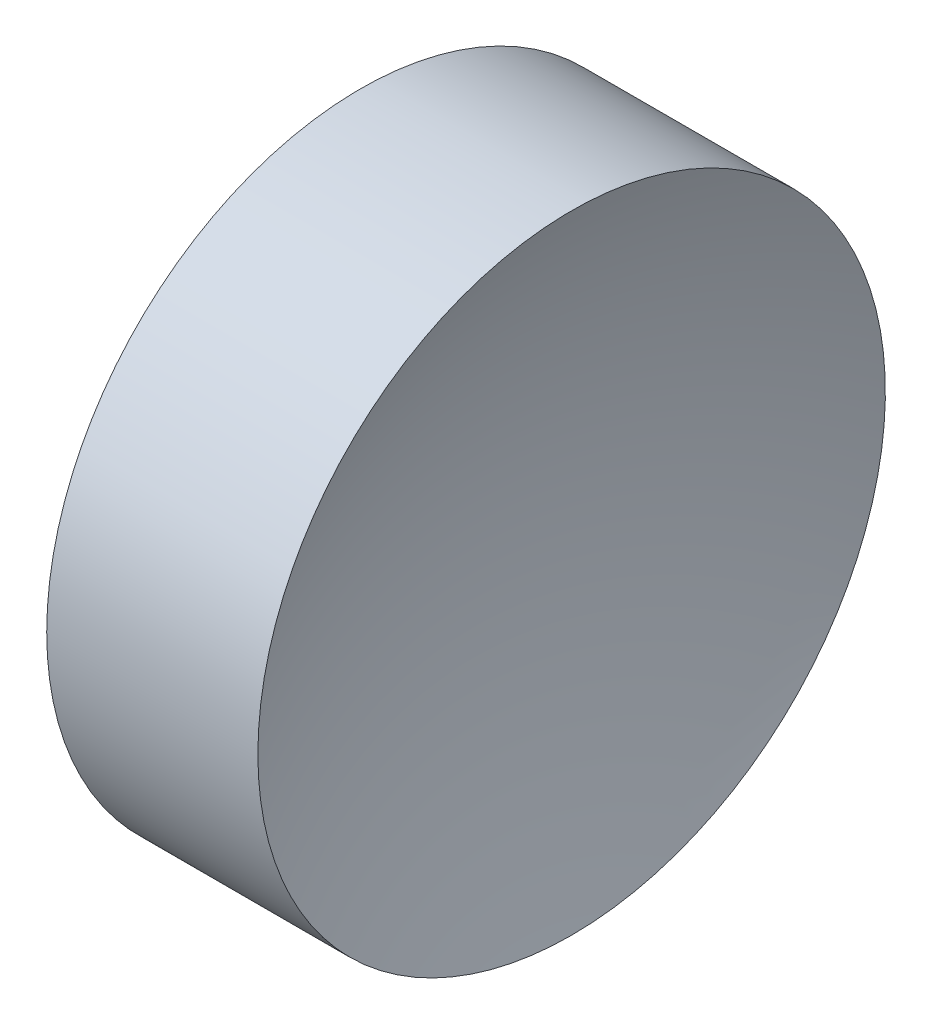
ISO-10303-21;
HEADER;
FILE_DESCRIPTION(('STEP AP214'),'2;1');
FILE_NAME('part.step','',(''),(''),'','','');
FILE_SCHEMA(('AUTOMOTIVE_DESIGN { 1 0 10303 214 1 1 1 1 }'));
ENDSEC;
DATA;
#1=APPLICATION_CONTEXT('core data for automotive mechanical design processes');
#2=APPLICATION_PROTOCOL_DEFINITION('international standard','automotive_design',2000,#1);
#3=PRODUCT_CONTEXT('',#1,'mechanical');
#4=PRODUCT('Part','Part','',(#3));
#5=PRODUCT_RELATED_PRODUCT_CATEGORY('part','',(#4));
#6=PRODUCT_DEFINITION_FORMATION('','',#4);
#7=PRODUCT_DEFINITION_CONTEXT('part definition',#1,'design');
#8=PRODUCT_DEFINITION('design','',#6,#7);
#9=PRODUCT_DEFINITION_SHAPE('','',#8);
#10=(LENGTH_UNIT() NAMED_UNIT(*) SI_UNIT(.MILLI.,.METRE.));
#11=(NAMED_UNIT(*) PLANE_ANGLE_UNIT() SI_UNIT($,.RADIAN.));
#12=(NAMED_UNIT(*) SI_UNIT($,.STERADIAN.) SOLID_ANGLE_UNIT());
#13=UNCERTAINTY_MEASURE_WITH_UNIT(LENGTH_MEASURE(1.E-05),#10,'distance_accuracy_value','');
#14=(GEOMETRIC_REPRESENTATION_CONTEXT(3) GLOBAL_UNCERTAINTY_ASSIGNED_CONTEXT((#13)) GLOBAL_UNIT_ASSIGNED_CONTEXT((#10,
#11,#12)) REPRESENTATION_CONTEXT('',''));
#15=CARTESIAN_POINT('',(0.,0.,0.));
#16=DIRECTION('',(0.,0.,1.));
#17=DIRECTION('',(1.,0.,0.));
#18=AXIS2_PLACEMENT_3D('',#15,#16,#17);
#19=CARTESIAN_POINT('',(31.984210290843,13.0445205745975,0.));
#20=DIRECTION('',(-1.,0.,0.));
#21=DIRECTION('',(0.,-1.,0.));
#22=AXIS2_PLACEMENT_3D('',#19,#20,#21);
#23=SPHERICAL_SURFACE('',#22,8.31202046606303);
#24=CARTESIAN_POINT('',(24.2921894752023,13.0445205745975,0.));
#25=DIRECTION('',(-1.,0.,0.));
#26=DIRECTION('',(0.,0.,1.));
#27=AXIS2_PLACEMENT_3D('',#24,#25,#26);
#28=CIRCLE('',#27,3.15);
#29=CARTESIAN_POINT('',(24.2921894752023,13.0445205745975,3.15));
#30=VERTEX_POINT('',#29);
#31=EDGE_CURVE('E10',#30,#30,#28,.T.);
#32=ORIENTED_EDGE('',*,*,#31,.F.);
#33=EDGE_LOOP('',(#32));
#34=FACE_BOUND('',#33,.T.);
#35=ADVANCED_FACE('F35',(#34),#23,.F.);
#36=CARTESIAN_POINT('',(21.2249305570684,13.0445205745975,0.));
#37=DIRECTION('',(-1.,0.,0.));
#38=DIRECTION('',(0.,0.,1.));
#39=AXIS2_PLACEMENT_3D('',#36,#37,#38);
#40=CYLINDRICAL_SURFACE('',#39,3.15);
#41=CARTESIAN_POINT('',(22.1721894752023,13.0445205745975,0.));
#42=DIRECTION('',(-1.,0.,0.));
#43=DIRECTION('',(0.,0.,1.));
#44=AXIS2_PLACEMENT_3D('',#41,#42,#43);
#45=CIRCLE('',#44,3.15);
#46=CARTESIAN_POINT('',(22.1721894752023,13.0445205745975,3.15));
#47=VERTEX_POINT('',#46);
#48=EDGE_CURVE('E41',#47,#47,#45,.T.);
#49=ORIENTED_EDGE('',*,*,#48,.F.);
#50=EDGE_LOOP('',(#49));
#51=FACE_BOUND('',#50,.T.);
#52=ORIENTED_EDGE('',*,*,#31,.T.);
#53=EDGE_LOOP('',(#52));
#54=FACE_BOUND('',#53,.T.);
#55=ADVANCED_FACE('F49',(#51,#54),#40,.T.);
#56=CARTESIAN_POINT('',(22.1721894752023,13.0445205745975,0.));
#57=DIRECTION('',(1.,0.,0.));
#58=DIRECTION('',(0.,0.,-1.));
#59=AXIS2_PLACEMENT_3D('',#56,#57,#58);
#60=PLANE('',#59);
#61=ORIENTED_EDGE('',*,*,#48,.T.);
#62=EDGE_LOOP('',(#61));
#63=FACE_BOUND('',#62,.T.);
#64=ADVANCED_FACE('F47',(#63),#60,.F.);
#65=CLOSED_SHELL('',(#35,#55,#64));
#66=MANIFOLD_SOLID_BREP('B2',#65);
#67=ADVANCED_BREP_SHAPE_REPRESENTATION('',(#18,#66),#14);
#68=SHAPE_DEFINITION_REPRESENTATION(#9,#67);
ENDSEC;
END-ISO-10303-21;
